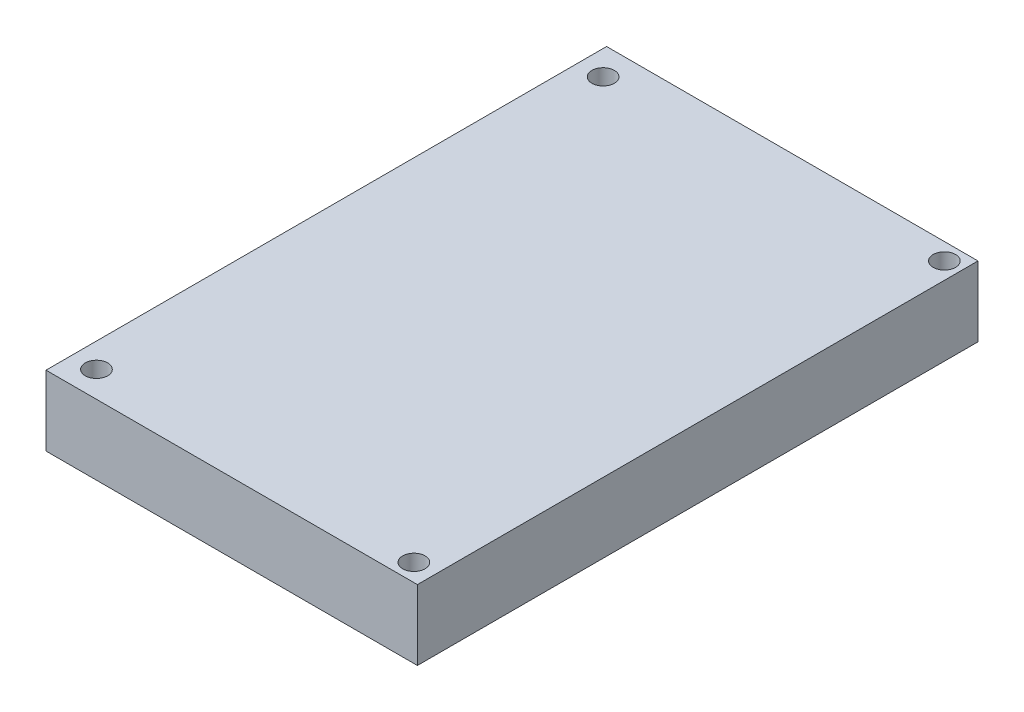
ISO-10303-21;
HEADER;
FILE_DESCRIPTION(('STEP AP214'),'2;1');
FILE_NAME('part.step','',(''),(''),'','','');
FILE_SCHEMA(('AUTOMOTIVE_DESIGN { 1 0 10303 214 1 1 1 1 }'));
ENDSEC;
DATA;
#1=APPLICATION_CONTEXT('core data for automotive mechanical design processes');
#2=APPLICATION_PROTOCOL_DEFINITION('international standard','automotive_design',2000,#1);
#3=PRODUCT_CONTEXT('',#1,'mechanical');
#4=PRODUCT('Part','Part','',(#3));
#5=PRODUCT_RELATED_PRODUCT_CATEGORY('part','',(#4));
#6=PRODUCT_DEFINITION_FORMATION('','',#4);
#7=PRODUCT_DEFINITION_CONTEXT('part definition',#1,'design');
#8=PRODUCT_DEFINITION('design','',#6,#7);
#9=PRODUCT_DEFINITION_SHAPE('','',#8);
#10=(LENGTH_UNIT() NAMED_UNIT(*) SI_UNIT(.MILLI.,.METRE.));
#11=(NAMED_UNIT(*) PLANE_ANGLE_UNIT() SI_UNIT($,.RADIAN.));
#12=(NAMED_UNIT(*) SI_UNIT($,.STERADIAN.) SOLID_ANGLE_UNIT());
#13=UNCERTAINTY_MEASURE_WITH_UNIT(LENGTH_MEASURE(1.E-05),#10,'distance_accuracy_value','');
#14=(GEOMETRIC_REPRESENTATION_CONTEXT(3) GLOBAL_UNCERTAINTY_ASSIGNED_CONTEXT((#13)) GLOBAL_UNIT_ASSIGNED_CONTEXT((#10,
#11,#12)) REPRESENTATION_CONTEXT('',''));
#15=CARTESIAN_POINT('',(0.,0.,0.));
#16=DIRECTION('',(0.,0.,1.));
#17=DIRECTION('',(1.,0.,0.));
#18=AXIS2_PLACEMENT_3D('',#15,#16,#17);
#19=CARTESIAN_POINT('',(0.,10.,0.));
#20=DIRECTION('',(0.,-1.,0.));
#21=DIRECTION('',(0.,0.,-1.));
#22=AXIS2_PLACEMENT_3D('',#19,#20,#21);
#23=PLANE('',#22);
#24=DIRECTION('',(0.,0.,-1.));
#25=VECTOR('',#24,1.);
#26=CARTESIAN_POINT('',(26.5,10.,40.));
#27=LINE('',#26,#25);
#28=CARTESIAN_POINT('',(26.5,10.,40.));
#29=VERTEX_POINT('',#28);
#30=CARTESIAN_POINT('',(26.5,10.,-40.));
#31=VERTEX_POINT('',#30);
#32=EDGE_CURVE('E92',#29,#31,#27,.T.);
#33=ORIENTED_EDGE('',*,*,#32,.T.);
#34=DIRECTION('',(-1.,0.,0.));
#35=VECTOR('',#34,1.);
#36=CARTESIAN_POINT('',(-26.5,10.,-40.));
#37=LINE('',#36,#35);
#38=CARTESIAN_POINT('',(-26.5,10.,-40.));
#39=VERTEX_POINT('',#38);
#40=EDGE_CURVE('E87',#31,#39,#37,.T.);
#41=ORIENTED_EDGE('',*,*,#40,.T.);
#42=DIRECTION('',(0.,0.,1.));
#43=VECTOR('',#42,1.);
#44=CARTESIAN_POINT('',(-26.5,10.,40.));
#45=LINE('',#44,#43);
#46=CARTESIAN_POINT('',(-26.5,10.,40.));
#47=VERTEX_POINT('',#46);
#48=EDGE_CURVE('E90',#39,#47,#45,.T.);
#49=ORIENTED_EDGE('',*,*,#48,.T.);
#50=DIRECTION('',(1.,0.,0.));
#51=VECTOR('',#50,1.);
#52=CARTESIAN_POINT('',(-26.5,10.,40.));
#53=LINE('',#52,#51);
#54=EDGE_CURVE('E57',#47,#29,#53,.T.);
#55=ORIENTED_EDGE('',*,*,#54,.T.);
#56=EDGE_LOOP('',(#33,#41,#49,#55));
#57=FACE_BOUND('',#56,.T.);
#58=CARTESIAN_POINT('',(-23.,10.,-36.));
#59=DIRECTION('',(0.,1.,0.));
#60=DIRECTION('',(0.,0.,1.));
#61=AXIS2_PLACEMENT_3D('',#58,#59,#60);
#62=CIRCLE('',#61,1.6);
#63=CARTESIAN_POINT('',(-23.,10.,-34.4));
#64=VERTEX_POINT('',#63);
#65=EDGE_CURVE('E112',#64,#64,#62,.T.);
#66=ORIENTED_EDGE('',*,*,#65,.F.);
#67=EDGE_LOOP('',(#66));
#68=FACE_BOUND('',#67,.T.);
#69=CARTESIAN_POINT('',(24.1,10.,-37.6));
#70=DIRECTION('',(0.,1.,0.));
#71=DIRECTION('',(0.,0.,1.));
#72=AXIS2_PLACEMENT_3D('',#69,#70,#71);
#73=CIRCLE('',#72,1.6);
#74=CARTESIAN_POINT('',(24.1,10.,-36.));
#75=VERTEX_POINT('',#74);
#76=EDGE_CURVE('E134',#75,#75,#73,.T.);
#77=ORIENTED_EDGE('',*,*,#76,.F.);
#78=EDGE_LOOP('',(#77));
#79=FACE_BOUND('',#78,.T.);
#80=CARTESIAN_POINT('',(23.5,10.,37.5));
#81=DIRECTION('',(0.,1.,0.));
#82=DIRECTION('',(0.,0.,1.));
#83=AXIS2_PLACEMENT_3D('',#80,#81,#82);
#84=CIRCLE('',#83,1.6);
#85=CARTESIAN_POINT('',(23.5,10.,39.1));
#86=VERTEX_POINT('',#85);
#87=EDGE_CURVE('E142',#86,#86,#84,.T.);
#88=ORIENTED_EDGE('',*,*,#87,.F.);
#89=EDGE_LOOP('',(#88));
#90=FACE_BOUND('',#89,.T.);
#91=CARTESIAN_POINT('',(-23.,10.,36.3));
#92=DIRECTION('',(0.,1.,0.));
#93=DIRECTION('',(0.,0.,1.));
#94=AXIS2_PLACEMENT_3D('',#91,#92,#93);
#95=CIRCLE('',#94,1.60000000000001);
#96=CARTESIAN_POINT('',(-23.,10.,37.9));
#97=VERTEX_POINT('',#96);
#98=EDGE_CURVE('E150',#97,#97,#95,.T.);
#99=ORIENTED_EDGE('',*,*,#98,.F.);
#100=EDGE_LOOP('',(#99));
#101=FACE_BOUND('',#100,.T.);
#102=ADVANCED_FACE('F39',(#57,#68,#79,#90,#101),#23,.F.);
#103=CARTESIAN_POINT('',(0.,0.,0.));
#104=DIRECTION('',(0.,-1.,0.));
#105=DIRECTION('',(0.,0.,-1.));
#106=AXIS2_PLACEMENT_3D('',#103,#104,#105);
#107=PLANE('',#106);
#108=CARTESIAN_POINT('',(23.5,0.,37.5));
#109=DIRECTION('',(0.,1.,0.));
#110=DIRECTION('',(0.,0.,1.));
#111=AXIS2_PLACEMENT_3D('',#108,#109,#110);
#112=CIRCLE('',#111,1.6);
#113=CARTESIAN_POINT('',(23.5,0.,39.1));
#114=VERTEX_POINT('',#113);
#115=EDGE_CURVE('E146',#114,#114,#112,.T.);
#116=ORIENTED_EDGE('',*,*,#115,.T.);
#117=EDGE_LOOP('',(#116));
#118=FACE_BOUND('',#117,.T.);
#119=CARTESIAN_POINT('',(-23.,0.,-36.));
#120=DIRECTION('',(0.,1.,0.));
#121=DIRECTION('',(0.,0.,1.));
#122=AXIS2_PLACEMENT_3D('',#119,#120,#121);
#123=CIRCLE('',#122,1.6);
#124=CARTESIAN_POINT('',(-23.,0.,-34.4));
#125=VERTEX_POINT('',#124);
#126=EDGE_CURVE('E130',#125,#125,#123,.T.);
#127=ORIENTED_EDGE('',*,*,#126,.T.);
#128=EDGE_LOOP('',(#127));
#129=FACE_BOUND('',#128,.T.);
#130=DIRECTION('',(0.,0.,-1.));
#131=VECTOR('',#130,1.);
#132=CARTESIAN_POINT('',(26.5,0.,40.));
#133=LINE('',#132,#131);
#134=CARTESIAN_POINT('',(26.5,0.,40.));
#135=VERTEX_POINT('',#134);
#136=CARTESIAN_POINT('',(26.5,0.,-40.));
#137=VERTEX_POINT('',#136);
#138=EDGE_CURVE('E108',#135,#137,#133,.T.);
#139=ORIENTED_EDGE('',*,*,#138,.F.);
#140=DIRECTION('',(1.,0.,0.));
#141=VECTOR('',#140,1.);
#142=CARTESIAN_POINT('',(-26.5,0.,40.));
#143=LINE('',#142,#141);
#144=CARTESIAN_POINT('',(-26.5,0.,40.));
#145=VERTEX_POINT('',#144);
#146=EDGE_CURVE('E80',#145,#135,#143,.T.);
#147=ORIENTED_EDGE('',*,*,#146,.F.);
#148=DIRECTION('',(0.,0.,1.));
#149=VECTOR('',#148,1.);
#150=CARTESIAN_POINT('',(-26.5,0.,40.));
#151=LINE('',#150,#149);
#152=CARTESIAN_POINT('',(-26.5,0.,-40.));
#153=VERTEX_POINT('',#152);
#154=EDGE_CURVE('E74',#153,#145,#151,.T.);
#155=ORIENTED_EDGE('',*,*,#154,.F.);
#156=DIRECTION('',(-1.,0.,0.));
#157=VECTOR('',#156,1.);
#158=CARTESIAN_POINT('',(-26.5,0.,-40.));
#159=LINE('',#158,#157);
#160=EDGE_CURVE('E97',#137,#153,#159,.T.);
#161=ORIENTED_EDGE('',*,*,#160,.F.);
#162=EDGE_LOOP('',(#139,#147,#155,#161));
#163=FACE_BOUND('',#162,.T.);
#164=CARTESIAN_POINT('',(24.1,0.,-37.6));
#165=DIRECTION('',(0.,1.,0.));
#166=DIRECTION('',(0.,0.,1.));
#167=AXIS2_PLACEMENT_3D('',#164,#165,#166);
#168=CIRCLE('',#167,1.6);
#169=CARTESIAN_POINT('',(24.1,0.,-36.));
#170=VERTEX_POINT('',#169);
#171=EDGE_CURVE('E138',#170,#170,#168,.T.);
#172=ORIENTED_EDGE('',*,*,#171,.T.);
#173=EDGE_LOOP('',(#172));
#174=FACE_BOUND('',#173,.T.);
#175=CARTESIAN_POINT('',(-23.,0.,36.3));
#176=DIRECTION('',(0.,1.,0.));
#177=DIRECTION('',(0.,0.,1.));
#178=AXIS2_PLACEMENT_3D('',#175,#176,#177);
#179=CIRCLE('',#178,1.60000000000001);
#180=CARTESIAN_POINT('',(-23.,0.,37.9));
#181=VERTEX_POINT('',#180);
#182=EDGE_CURVE('E154',#181,#181,#179,.T.);
#183=ORIENTED_EDGE('',*,*,#182,.T.);
#184=EDGE_LOOP('',(#183));
#185=FACE_BOUND('',#184,.T.);
#186=ADVANCED_FACE('F125',(#118,#129,#163,#174,#185),#107,.T.);
#187=CARTESIAN_POINT('',(26.5,10.,40.));
#188=DIRECTION('',(-1.,0.,0.));
#189=DIRECTION('',(0.,0.,1.));
#190=AXIS2_PLACEMENT_3D('',#187,#188,#189);
#191=PLANE('',#190);
#192=ORIENTED_EDGE('',*,*,#138,.T.);
#193=DIRECTION('',(0.,-1.,0.));
#194=VECTOR('',#193,1.);
#195=CARTESIAN_POINT('',(26.5,10.,-40.));
#196=LINE('',#195,#194);
#197=EDGE_CURVE('E11',#31,#137,#196,.T.);
#198=ORIENTED_EDGE('',*,*,#197,.F.);
#199=ORIENTED_EDGE('',*,*,#32,.F.);
#200=DIRECTION('',(0.,-1.,0.));
#201=VECTOR('',#200,1.);
#202=CARTESIAN_POINT('',(26.5,10.,40.));
#203=LINE('',#202,#201);
#204=EDGE_CURVE('E104',#29,#135,#203,.T.);
#205=ORIENTED_EDGE('',*,*,#204,.T.);
#206=EDGE_LOOP('',(#192,#198,#199,#205));
#207=FACE_BOUND('',#206,.T.);
#208=ADVANCED_FACE('F41',(#207),#191,.F.);
#209=CARTESIAN_POINT('',(-26.5,10.,-40.));
#210=DIRECTION('',(0.,0.,1.));
#211=DIRECTION('',(1.,0.,0.));
#212=AXIS2_PLACEMENT_3D('',#209,#210,#211);
#213=PLANE('',#212);
#214=ORIENTED_EDGE('',*,*,#160,.T.);
#215=DIRECTION('',(0.,-1.,0.));
#216=VECTOR('',#215,1.);
#217=CARTESIAN_POINT('',(-26.5,10.,-40.));
#218=LINE('',#217,#216);
#219=EDGE_CURVE('E49',#39,#153,#218,.T.);
#220=ORIENTED_EDGE('',*,*,#219,.F.);
#221=ORIENTED_EDGE('',*,*,#40,.F.);
#222=ORIENTED_EDGE('',*,*,#197,.T.);
#223=EDGE_LOOP('',(#214,#220,#221,#222));
#224=FACE_BOUND('',#223,.T.);
#225=ADVANCED_FACE('F96',(#224),#213,.F.);
#226=CARTESIAN_POINT('',(-26.5,10.,40.));
#227=DIRECTION('',(1.,0.,0.));
#228=DIRECTION('',(0.,0.,-1.));
#229=AXIS2_PLACEMENT_3D('',#226,#227,#228);
#230=PLANE('',#229);
#231=ORIENTED_EDGE('',*,*,#154,.T.);
#232=DIRECTION('',(0.,-1.,0.));
#233=VECTOR('',#232,1.);
#234=CARTESIAN_POINT('',(-26.5,10.,40.));
#235=LINE('',#234,#233);
#236=EDGE_CURVE('E99',#47,#145,#235,.T.);
#237=ORIENTED_EDGE('',*,*,#236,.F.);
#238=ORIENTED_EDGE('',*,*,#48,.F.);
#239=ORIENTED_EDGE('',*,*,#219,.T.);
#240=EDGE_LOOP('',(#231,#237,#238,#239));
#241=FACE_BOUND('',#240,.T.);
#242=ADVANCED_FACE('F100',(#241),#230,.F.);
#243=CARTESIAN_POINT('',(-26.5,10.,40.));
#244=DIRECTION('',(0.,0.,-1.));
#245=DIRECTION('',(-1.,0.,0.));
#246=AXIS2_PLACEMENT_3D('',#243,#244,#245);
#247=PLANE('',#246);
#248=ORIENTED_EDGE('',*,*,#146,.T.);
#249=ORIENTED_EDGE('',*,*,#204,.F.);
#250=ORIENTED_EDGE('',*,*,#54,.F.);
#251=ORIENTED_EDGE('',*,*,#236,.T.);
#252=EDGE_LOOP('',(#248,#249,#250,#251));
#253=FACE_BOUND('',#252,.T.);
#254=ADVANCED_FACE('F122',(#253),#247,.F.);
#255=CARTESIAN_POINT('',(-23.,10.,-36.));
#256=DIRECTION('',(0.,-1.,0.));
#257=DIRECTION('',(0.,0.,-1.));
#258=AXIS2_PLACEMENT_3D('',#255,#256,#257);
#259=CYLINDRICAL_SURFACE('',#258,1.6);
#260=ORIENTED_EDGE('',*,*,#65,.T.);
#261=EDGE_LOOP('',(#260));
#262=FACE_BOUND('',#261,.T.);
#263=ORIENTED_EDGE('',*,*,#126,.F.);
#264=EDGE_LOOP('',(#263));
#265=FACE_BOUND('',#264,.T.);
#266=ADVANCED_FACE('F173',(#262,#265),#259,.F.);
#267=CARTESIAN_POINT('',(24.1,10.,-37.6));
#268=DIRECTION('',(0.,-1.,0.));
#269=DIRECTION('',(0.,0.,-1.));
#270=AXIS2_PLACEMENT_3D('',#267,#268,#269);
#271=CYLINDRICAL_SURFACE('',#270,1.6);
#272=ORIENTED_EDGE('',*,*,#76,.T.);
#273=EDGE_LOOP('',(#272));
#274=FACE_BOUND('',#273,.T.);
#275=ORIENTED_EDGE('',*,*,#171,.F.);
#276=EDGE_LOOP('',(#275));
#277=FACE_BOUND('',#276,.T.);
#278=ADVANCED_FACE('F219',(#274,#277),#271,.F.);
#279=CARTESIAN_POINT('',(23.5,10.,37.5));
#280=DIRECTION('',(0.,-1.,0.));
#281=DIRECTION('',(0.,0.,-1.));
#282=AXIS2_PLACEMENT_3D('',#279,#280,#281);
#283=CYLINDRICAL_SURFACE('',#282,1.6);
#284=ORIENTED_EDGE('',*,*,#87,.T.);
#285=EDGE_LOOP('',(#284));
#286=FACE_BOUND('',#285,.T.);
#287=ORIENTED_EDGE('',*,*,#115,.F.);
#288=EDGE_LOOP('',(#287));
#289=FACE_BOUND('',#288,.T.);
#290=ADVANCED_FACE('F227',(#286,#289),#283,.F.);
#291=CARTESIAN_POINT('',(-23.,10.,36.3));
#292=DIRECTION('',(0.,-1.,0.));
#293=DIRECTION('',(0.,0.,-1.));
#294=AXIS2_PLACEMENT_3D('',#291,#292,#293);
#295=CYLINDRICAL_SURFACE('',#294,1.60000000000001);
#296=ORIENTED_EDGE('',*,*,#98,.T.);
#297=EDGE_LOOP('',(#296));
#298=FACE_BOUND('',#297,.T.);
#299=ORIENTED_EDGE('',*,*,#182,.F.);
#300=EDGE_LOOP('',(#299));
#301=FACE_BOUND('',#300,.T.);
#302=ADVANCED_FACE('F162',(#298,#301),#295,.F.);
#303=CLOSED_SHELL('',(#102,#186,#208,#225,#242,#254,#266,#278,#290,#302));
#304=MANIFOLD_SOLID_BREP('B2',#303);
#305=ADVANCED_BREP_SHAPE_REPRESENTATION('',(#18,#304),#14);
#306=SHAPE_DEFINITION_REPRESENTATION(#9,#305);
ENDSEC;
END-ISO-10303-21;
